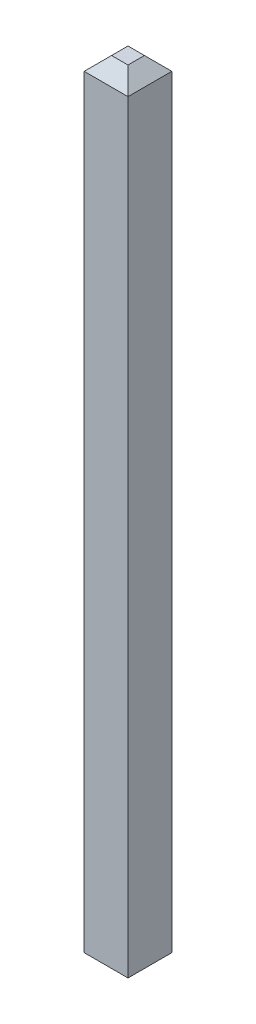
ISO-10303-21;
HEADER;
FILE_DESCRIPTION(('STEP AP214'),'2;1');
FILE_NAME('part.step','',(''),(''),'','','');
FILE_SCHEMA(('AUTOMOTIVE_DESIGN { 1 0 10303 214 1 1 1 1 }'));
ENDSEC;
DATA;
#1=APPLICATION_CONTEXT('core data for automotive mechanical design processes');
#2=APPLICATION_PROTOCOL_DEFINITION('international standard','automotive_design',2000,#1);
#3=PRODUCT_CONTEXT('',#1,'mechanical');
#4=PRODUCT('Part','Part','',(#3));
#5=PRODUCT_RELATED_PRODUCT_CATEGORY('part','',(#4));
#6=PRODUCT_DEFINITION_FORMATION('','',#4);
#7=PRODUCT_DEFINITION_CONTEXT('part definition',#1,'design');
#8=PRODUCT_DEFINITION('design','',#6,#7);
#9=PRODUCT_DEFINITION_SHAPE('','',#8);
#10=(LENGTH_UNIT() NAMED_UNIT(*) SI_UNIT(.MILLI.,.METRE.));
#11=(NAMED_UNIT(*) PLANE_ANGLE_UNIT() SI_UNIT($,.RADIAN.));
#12=(NAMED_UNIT(*) SI_UNIT($,.STERADIAN.) SOLID_ANGLE_UNIT());
#13=UNCERTAINTY_MEASURE_WITH_UNIT(LENGTH_MEASURE(1.E-05),#10,'distance_accuracy_value','');
#14=(GEOMETRIC_REPRESENTATION_CONTEXT(3) GLOBAL_UNCERTAINTY_ASSIGNED_CONTEXT((#13)) GLOBAL_UNIT_ASSIGNED_CONTEXT((#10,
#11,#12)) REPRESENTATION_CONTEXT('',''));
#15=CARTESIAN_POINT('',(0.,0.,0.));
#16=DIRECTION('',(0.,0.,1.));
#17=DIRECTION('',(1.,0.,0.));
#18=AXIS2_PLACEMENT_3D('',#15,#16,#17);
#19=CARTESIAN_POINT('',(-0.319999999999999,11.54,0.32));
#20=DIRECTION('',(1.,0.,0.));
#21=DIRECTION('',(0.,0.,-1.));
#22=AXIS2_PLACEMENT_3D('',#19,#20,#21);
#23=PLANE('',#22);
#24=DIRECTION('',(0.,-1.,0.));
#25=VECTOR('',#24,1.);
#26=CARTESIAN_POINT('',(-0.319999999999999,11.54,-0.319999999999999));
#27=LINE('',#26,#25);
#28=CARTESIAN_POINT('',(-0.319999999999999,11.34,-0.319999999999999));
#29=VERTEX_POINT('',#28);
#30=CARTESIAN_POINT('',(-0.319999999999999,0.200000000000001,-0.319999999999999));
#31=VERTEX_POINT('',#30);
#32=EDGE_CURVE('E141',#29,#31,#27,.T.);
#33=ORIENTED_EDGE('',*,*,#32,.T.);
#34=DIRECTION('',(0.,0.,1.));
#35=VECTOR('',#34,1.);
#36=CARTESIAN_POINT('',(-0.319999999999999,0.200000000000001,0.32));
#37=LINE('',#36,#35);
#38=CARTESIAN_POINT('',(-0.319999999999999,0.200000000000001,0.32));
#39=VERTEX_POINT('',#38);
#40=EDGE_CURVE('E150',#31,#39,#37,.T.);
#41=ORIENTED_EDGE('',*,*,#40,.T.);
#42=DIRECTION('',(0.,-1.,0.));
#43=VECTOR('',#42,1.);
#44=CARTESIAN_POINT('',(-0.319999999999999,11.54,0.32));
#45=LINE('',#44,#43);
#46=CARTESIAN_POINT('',(-0.319999999999999,11.34,0.32));
#47=VERTEX_POINT('',#46);
#48=EDGE_CURVE('E119',#47,#39,#45,.T.);
#49=ORIENTED_EDGE('',*,*,#48,.F.);
#50=DIRECTION('',(0.,0.,-1.));
#51=VECTOR('',#50,1.);
#52=CARTESIAN_POINT('',(-0.319999999999999,11.34,-0.319999999999999));
#53=LINE('',#52,#51);
#54=EDGE_CURVE('E152',#47,#29,#53,.T.);
#55=ORIENTED_EDGE('',*,*,#54,.T.);
#56=EDGE_LOOP('',(#33,#41,#49,#55));
#57=FACE_BOUND('',#56,.T.);
#58=ADVANCED_FACE('F32',(#57),#23,.F.);
#59=CARTESIAN_POINT('',(0.320000000000001,11.54,0.320000000000001));
#60=DIRECTION('',(0.,0.,-1.));
#61=DIRECTION('',(-1.,0.,0.));
#62=AXIS2_PLACEMENT_3D('',#59,#60,#61);
#63=PLANE('',#62);
#64=ORIENTED_EDGE('',*,*,#48,.T.);
#65=DIRECTION('',(1.,0.,0.));
#66=VECTOR('',#65,1.);
#67=CARTESIAN_POINT('',(0.320000000000001,0.200000000000001,0.320000000000001));
#68=LINE('',#67,#66);
#69=CARTESIAN_POINT('',(0.320000000000001,0.200000000000001,0.320000000000001));
#70=VERTEX_POINT('',#69);
#71=EDGE_CURVE('E118',#39,#70,#68,.T.);
#72=ORIENTED_EDGE('',*,*,#71,.T.);
#73=DIRECTION('',(0.,-1.,0.));
#74=VECTOR('',#73,1.);
#75=CARTESIAN_POINT('',(0.320000000000001,11.54,0.320000000000001));
#76=LINE('',#75,#74);
#77=CARTESIAN_POINT('',(0.320000000000001,11.34,0.320000000000001));
#78=VERTEX_POINT('',#77);
#79=EDGE_CURVE('E101',#78,#70,#76,.T.);
#80=ORIENTED_EDGE('',*,*,#79,.F.);
#81=DIRECTION('',(-1.,0.,0.));
#82=VECTOR('',#81,1.);
#83=CARTESIAN_POINT('',(-0.319999999999999,11.34,0.32));
#84=LINE('',#83,#82);
#85=EDGE_CURVE('E115',#78,#47,#84,.T.);
#86=ORIENTED_EDGE('',*,*,#85,.T.);
#87=EDGE_LOOP('',(#64,#72,#80,#86));
#88=FACE_BOUND('',#87,.T.);
#89=ADVANCED_FACE('F114',(#88),#63,.F.);
#90=CARTESIAN_POINT('',(0.320000000000001,11.54,0.320000000000001));
#91=DIRECTION('',(-1.,0.,0.));
#92=DIRECTION('',(0.,0.,1.));
#93=AXIS2_PLACEMENT_3D('',#90,#91,#92);
#94=PLANE('',#93);
#95=ORIENTED_EDGE('',*,*,#79,.T.);
#96=DIRECTION('',(0.,0.,-1.));
#97=VECTOR('',#96,1.);
#98=CARTESIAN_POINT('',(0.320000000000001,0.200000000000001,0.320000000000001));
#99=LINE('',#98,#97);
#100=CARTESIAN_POINT('',(0.320000000000001,0.200000000000001,-0.319999999999999));
#101=VERTEX_POINT('',#100);
#102=EDGE_CURVE('E107',#70,#101,#99,.T.);
#103=ORIENTED_EDGE('',*,*,#102,.T.);
#104=DIRECTION('',(0.,-1.,0.));
#105=VECTOR('',#104,1.);
#106=CARTESIAN_POINT('',(0.320000000000001,11.54,-0.319999999999999));
#107=LINE('',#106,#105);
#108=CARTESIAN_POINT('',(0.320000000000001,11.34,-0.319999999999999));
#109=VERTEX_POINT('',#108);
#110=EDGE_CURVE('E103',#109,#101,#107,.T.);
#111=ORIENTED_EDGE('',*,*,#110,.F.);
#112=DIRECTION('',(0.,0.,1.));
#113=VECTOR('',#112,1.);
#114=CARTESIAN_POINT('',(0.320000000000001,11.34,0.320000000000001));
#115=LINE('',#114,#113);
#116=EDGE_CURVE('E98',#109,#78,#115,.T.);
#117=ORIENTED_EDGE('',*,*,#116,.T.);
#118=EDGE_LOOP('',(#95,#103,#111,#117));
#119=FACE_BOUND('',#118,.T.);
#120=ADVANCED_FACE('F100',(#119),#94,.F.);
#121=CARTESIAN_POINT('',(0.320000000000001,11.54,-0.319999999999999));
#122=DIRECTION('',(0.,0.,1.));
#123=DIRECTION('',(1.,0.,0.));
#124=AXIS2_PLACEMENT_3D('',#121,#122,#123);
#125=PLANE('',#124);
#126=ORIENTED_EDGE('',*,*,#110,.T.);
#127=DIRECTION('',(-1.,0.,0.));
#128=VECTOR('',#127,1.);
#129=CARTESIAN_POINT('',(0.320000000000001,0.200000000000001,-0.319999999999999));
#130=LINE('',#129,#128);
#131=EDGE_CURVE('E154',#101,#31,#130,.T.);
#132=ORIENTED_EDGE('',*,*,#131,.T.);
#133=ORIENTED_EDGE('',*,*,#32,.F.);
#134=DIRECTION('',(1.,0.,0.));
#135=VECTOR('',#134,1.);
#136=CARTESIAN_POINT('',(0.320000000000001,11.34,-0.319999999999999));
#137=LINE('',#136,#135);
#138=EDGE_CURVE('E156',#29,#109,#137,.T.);
#139=ORIENTED_EDGE('',*,*,#138,.T.);
#140=EDGE_LOOP('',(#126,#132,#133,#139));
#141=FACE_BOUND('',#140,.T.);
#142=ADVANCED_FACE('F194',(#141),#125,.F.);
#143=CARTESIAN_POINT('',(0.,11.54,0.));
#144=DIRECTION('',(0.,1.,0.));
#145=DIRECTION('',(0.,0.,1.));
#146=AXIS2_PLACEMENT_3D('',#143,#144,#145);
#147=PLANE('',#146);
#148=DIRECTION('',(0.,0.,-1.));
#149=VECTOR('',#148,1.);
#150=CARTESIAN_POINT('',(0.119999999999999,11.54,-0.319999999999999));
#151=LINE('',#150,#149);
#152=CARTESIAN_POINT('',(0.119999999999999,11.54,0.119999999999998));
#153=VERTEX_POINT('',#152);
#154=CARTESIAN_POINT('',(0.119999999999999,11.54,-0.119999999999997));
#155=VERTEX_POINT('',#154);
#156=EDGE_CURVE('E41',#153,#155,#151,.T.);
#157=ORIENTED_EDGE('',*,*,#156,.T.);
#158=DIRECTION('',(-1.,0.,0.));
#159=VECTOR('',#158,1.);
#160=CARTESIAN_POINT('',(-0.319999999999999,11.54,-0.119999999999996));
#161=LINE('',#160,#159);
#162=CARTESIAN_POINT('',(-0.119999999999997,11.54,-0.119999999999997));
#163=VERTEX_POINT('',#162);
#164=EDGE_CURVE('E11',#155,#163,#161,.T.);
#165=ORIENTED_EDGE('',*,*,#164,.T.);
#166=DIRECTION('',(0.,0.,1.));
#167=VECTOR('',#166,1.);
#168=CARTESIAN_POINT('',(-0.119999999999996,11.54,0.32));
#169=LINE('',#168,#167);
#170=CARTESIAN_POINT('',(-0.119999999999997,11.54,0.119999999999998));
#171=VERTEX_POINT('',#170);
#172=EDGE_CURVE('E148',#163,#171,#169,.T.);
#173=ORIENTED_EDGE('',*,*,#172,.T.);
#174=DIRECTION('',(1.,0.,0.));
#175=VECTOR('',#174,1.);
#176=CARTESIAN_POINT('',(0.320000000000002,11.54,0.119999999999999));
#177=LINE('',#176,#175);
#178=EDGE_CURVE('E52',#171,#153,#177,.T.);
#179=ORIENTED_EDGE('',*,*,#178,.T.);
#180=EDGE_LOOP('',(#157,#165,#173,#179));
#181=FACE_BOUND('',#180,.T.);
#182=ADVANCED_FACE('F200',(#181),#147,.T.);
#183=CARTESIAN_POINT('',(0.,0.,0.));
#184=DIRECTION('',(0.,1.,0.));
#185=DIRECTION('',(0.,0.,1.));
#186=AXIS2_PLACEMENT_3D('',#183,#184,#185);
#187=PLANE('',#186);
#188=DIRECTION('',(0.,0.,1.));
#189=VECTOR('',#188,1.);
#190=CARTESIAN_POINT('',(0.120000000000001,0.,0.));
#191=LINE('',#190,#189);
#192=CARTESIAN_POINT('',(0.120000000000001,0.,-0.119999999999998));
#193=VERTEX_POINT('',#192);
#194=CARTESIAN_POINT('',(0.120000000000001,0.,0.12));
#195=VERTEX_POINT('',#194);
#196=EDGE_CURVE('E161',#193,#195,#191,.T.);
#197=ORIENTED_EDGE('',*,*,#196,.T.);
#198=DIRECTION('',(-1.,0.,0.));
#199=VECTOR('',#198,1.);
#200=CARTESIAN_POINT('',(0.,0.,0.12));
#201=LINE('',#200,#199);
#202=CARTESIAN_POINT('',(-0.119999999999998,0.,0.12));
#203=VERTEX_POINT('',#202);
#204=EDGE_CURVE('E108',#195,#203,#201,.T.);
#205=ORIENTED_EDGE('',*,*,#204,.T.);
#206=DIRECTION('',(0.,0.,-1.));
#207=VECTOR('',#206,1.);
#208=CARTESIAN_POINT('',(-0.119999999999998,0.,0.));
#209=LINE('',#208,#207);
#210=CARTESIAN_POINT('',(-0.119999999999998,0.,-0.119999999999998));
#211=VERTEX_POINT('',#210);
#212=EDGE_CURVE('E165',#203,#211,#209,.T.);
#213=ORIENTED_EDGE('',*,*,#212,.T.);
#214=DIRECTION('',(1.,0.,0.));
#215=VECTOR('',#214,1.);
#216=CARTESIAN_POINT('',(0.,0.,-0.119999999999998));
#217=LINE('',#216,#215);
#218=EDGE_CURVE('E163',#211,#193,#217,.T.);
#219=ORIENTED_EDGE('',*,*,#218,.T.);
#220=EDGE_LOOP('',(#197,#205,#213,#219));
#221=FACE_BOUND('',#220,.T.);
#222=ADVANCED_FACE('F202',(#221),#187,.F.);
#223=CARTESIAN_POINT('',(0.320000000000001,0.200000000000001,-0.319999999999999));
#224=DIRECTION('',(0.,0.707106781186547,0.707106781186547));
#225=DIRECTION('',(-1.,0.,0.));
#226=AXIS2_PLACEMENT_3D('',#223,#224,#225);
#227=PLANE('',#226);
#228=DIRECTION('',(-0.577350269189626,-0.577350269189626,0.577350269189626));
#229=VECTOR('',#228,1.);
#230=CARTESIAN_POINT('',(0.320000000000001,0.200000000000001,-0.319999999999999));
#231=LINE('',#230,#229);
#232=EDGE_CURVE('E142',#193,#101,#231,.F.);
#233=ORIENTED_EDGE('',*,*,#232,.F.);
#234=ORIENTED_EDGE('',*,*,#218,.F.);
#235=DIRECTION('',(0.577350269189626,-0.577350269189626,0.577350269189626));
#236=VECTOR('',#235,1.);
#237=CARTESIAN_POINT('',(-0.106666666666666,-0.0133333333333324,-0.106666666666666));
#238=LINE('',#237,#236);
#239=EDGE_CURVE('E138',#31,#211,#238,.T.);
#240=ORIENTED_EDGE('',*,*,#239,.F.);
#241=ORIENTED_EDGE('',*,*,#131,.F.);
#242=EDGE_LOOP('',(#233,#234,#240,#241));
#243=FACE_BOUND('',#242,.T.);
#244=ADVANCED_FACE('F181',(#243),#227,.F.);
#245=CARTESIAN_POINT('',(-0.319999999999999,0.200000000000001,0.32));
#246=DIRECTION('',(0.707106781186547,0.707106781186547,0.));
#247=DIRECTION('',(0.,0.,1.));
#248=AXIS2_PLACEMENT_3D('',#245,#246,#247);
#249=PLANE('',#248);
#250=ORIENTED_EDGE('',*,*,#239,.T.);
#251=ORIENTED_EDGE('',*,*,#212,.F.);
#252=DIRECTION('',(-0.577350269189626,0.577350269189626,0.577350269189625));
#253=VECTOR('',#252,1.);
#254=CARTESIAN_POINT('',(-0.319999999999999,0.200000000000001,0.32));
#255=LINE('',#254,#253);
#256=EDGE_CURVE('E129',#39,#203,#255,.F.);
#257=ORIENTED_EDGE('',*,*,#256,.F.);
#258=ORIENTED_EDGE('',*,*,#40,.F.);
#259=EDGE_LOOP('',(#250,#251,#257,#258));
#260=FACE_BOUND('',#259,.T.);
#261=ADVANCED_FACE('F185',(#260),#249,.F.);
#262=CARTESIAN_POINT('',(0.320000000000001,0.200000000000001,0.320000000000001));
#263=DIRECTION('',(-0.707106781186547,0.707106781186547,0.));
#264=DIRECTION('',(0.,0.,-1.));
#265=AXIS2_PLACEMENT_3D('',#262,#263,#264);
#266=PLANE('',#265);
#267=ORIENTED_EDGE('',*,*,#232,.T.);
#268=ORIENTED_EDGE('',*,*,#102,.F.);
#269=DIRECTION('',(-0.577350269189626,-0.577350269189625,-0.577350269189626));
#270=VECTOR('',#269,1.);
#271=CARTESIAN_POINT('',(0.320000000000001,0.200000000000001,0.320000000000001));
#272=LINE('',#271,#270);
#273=EDGE_CURVE('E128',#195,#70,#272,.F.);
#274=ORIENTED_EDGE('',*,*,#273,.F.);
#275=ORIENTED_EDGE('',*,*,#196,.F.);
#276=EDGE_LOOP('',(#267,#268,#274,#275));
#277=FACE_BOUND('',#276,.T.);
#278=ADVANCED_FACE('F193',(#277),#266,.F.);
#279=CARTESIAN_POINT('',(0.320000000000001,0.200000000000001,0.320000000000001));
#280=DIRECTION('',(0.,0.707106781186547,-0.707106781186547));
#281=DIRECTION('',(1.,0.,0.));
#282=AXIS2_PLACEMENT_3D('',#279,#280,#281);
#283=PLANE('',#282);
#284=ORIENTED_EDGE('',*,*,#256,.T.);
#285=ORIENTED_EDGE('',*,*,#204,.F.);
#286=ORIENTED_EDGE('',*,*,#273,.T.);
#287=ORIENTED_EDGE('',*,*,#71,.F.);
#288=EDGE_LOOP('',(#284,#285,#286,#287));
#289=FACE_BOUND('',#288,.T.);
#290=ADVANCED_FACE('F188',(#289),#283,.F.);
#291=CARTESIAN_POINT('',(0.,11.54,0.119999999999998));
#292=DIRECTION('',(0.,0.707106781186544,0.707106781186551));
#293=DIRECTION('',(-1.,0.,0.));
#294=AXIS2_PLACEMENT_3D('',#291,#292,#293);
#295=PLANE('',#294);
#296=DIRECTION('',(0.577350269189624,0.57735026918963,-0.577350269189624));
#297=VECTOR('',#296,1.);
#298=CARTESIAN_POINT('',(-0.0799999999999975,11.58,0.079999999999999));
#299=LINE('',#298,#297);
#300=EDGE_CURVE('E124',#47,#171,#299,.T.);
#301=ORIENTED_EDGE('',*,*,#300,.F.);
#302=ORIENTED_EDGE('',*,*,#85,.F.);
#303=DIRECTION('',(-0.577350269189624,0.577350269189629,-0.577350269189625));
#304=VECTOR('',#303,1.);
#305=CARTESIAN_POINT('',(0.0799999999999995,11.58,0.0799999999999988));
#306=LINE('',#305,#304);
#307=EDGE_CURVE('E36',#153,#78,#306,.F.);
#308=ORIENTED_EDGE('',*,*,#307,.F.);
#309=ORIENTED_EDGE('',*,*,#178,.F.);
#310=EDGE_LOOP('',(#301,#302,#308,#309));
#311=FACE_BOUND('',#310,.T.);
#312=ADVANCED_FACE('F34',(#311),#295,.T.);
#313=CARTESIAN_POINT('',(0.119999999999999,11.54,0.));
#314=DIRECTION('',(0.707106781186551,0.707106781186544,0.));
#315=DIRECTION('',(0.,0.,1.));
#316=AXIS2_PLACEMENT_3D('',#313,#314,#315);
#317=PLANE('',#316);
#318=ORIENTED_EDGE('',*,*,#307,.T.);
#319=ORIENTED_EDGE('',*,*,#116,.F.);
#320=DIRECTION('',(-0.577350269189624,0.577350269189629,0.577350269189624));
#321=VECTOR('',#320,1.);
#322=CARTESIAN_POINT('',(0.0800000000000003,11.58,-0.079999999999998));
#323=LINE('',#322,#321);
#324=EDGE_CURVE('E131',#155,#109,#323,.F.);
#325=ORIENTED_EDGE('',*,*,#324,.F.);
#326=ORIENTED_EDGE('',*,*,#156,.F.);
#327=EDGE_LOOP('',(#318,#319,#325,#326));
#328=FACE_BOUND('',#327,.T.);
#329=ADVANCED_FACE('F127',(#328),#317,.T.);
#330=CARTESIAN_POINT('',(-0.119999999999997,11.54,0.));
#331=DIRECTION('',(-0.707106781186551,0.707106781186544,0.));
#332=DIRECTION('',(0.,0.,-1.));
#333=AXIS2_PLACEMENT_3D('',#330,#331,#332);
#334=PLANE('',#333);
#335=ORIENTED_EDGE('',*,*,#300,.T.);
#336=ORIENTED_EDGE('',*,*,#172,.F.);
#337=DIRECTION('',(-0.577350269189624,-0.577350269189629,-0.577350269189624));
#338=VECTOR('',#337,1.);
#339=CARTESIAN_POINT('',(-0.079999999999998,11.58,-0.0799999999999979));
#340=LINE('',#339,#338);
#341=EDGE_CURVE('E134',#29,#163,#340,.F.);
#342=ORIENTED_EDGE('',*,*,#341,.F.);
#343=ORIENTED_EDGE('',*,*,#54,.F.);
#344=EDGE_LOOP('',(#335,#336,#342,#343));
#345=FACE_BOUND('',#344,.T.);
#346=ADVANCED_FACE('F199',(#345),#334,.T.);
#347=CARTESIAN_POINT('',(0.,11.54,-0.119999999999997));
#348=DIRECTION('',(0.,0.707106781186544,-0.707106781186551));
#349=DIRECTION('',(1.,0.,0.));
#350=AXIS2_PLACEMENT_3D('',#347,#348,#349);
#351=PLANE('',#350);
#352=ORIENTED_EDGE('',*,*,#324,.T.);
#353=ORIENTED_EDGE('',*,*,#138,.F.);
#354=ORIENTED_EDGE('',*,*,#341,.T.);
#355=ORIENTED_EDGE('',*,*,#164,.F.);
#356=EDGE_LOOP('',(#352,#353,#354,#355));
#357=FACE_BOUND('',#356,.T.);
#358=ADVANCED_FACE('F197',(#357),#351,.T.);
#359=CLOSED_SHELL('',(#58,#89,#120,#142,#182,#222,#244,#261,#278,#290,#312,#329,#346,#358));
#360=MANIFOLD_SOLID_BREP('B2',#359);
#361=ADVANCED_BREP_SHAPE_REPRESENTATION('',(#18,#360),#14);
#362=SHAPE_DEFINITION_REPRESENTATION(#9,#361);
ENDSEC;
END-ISO-10303-21;
